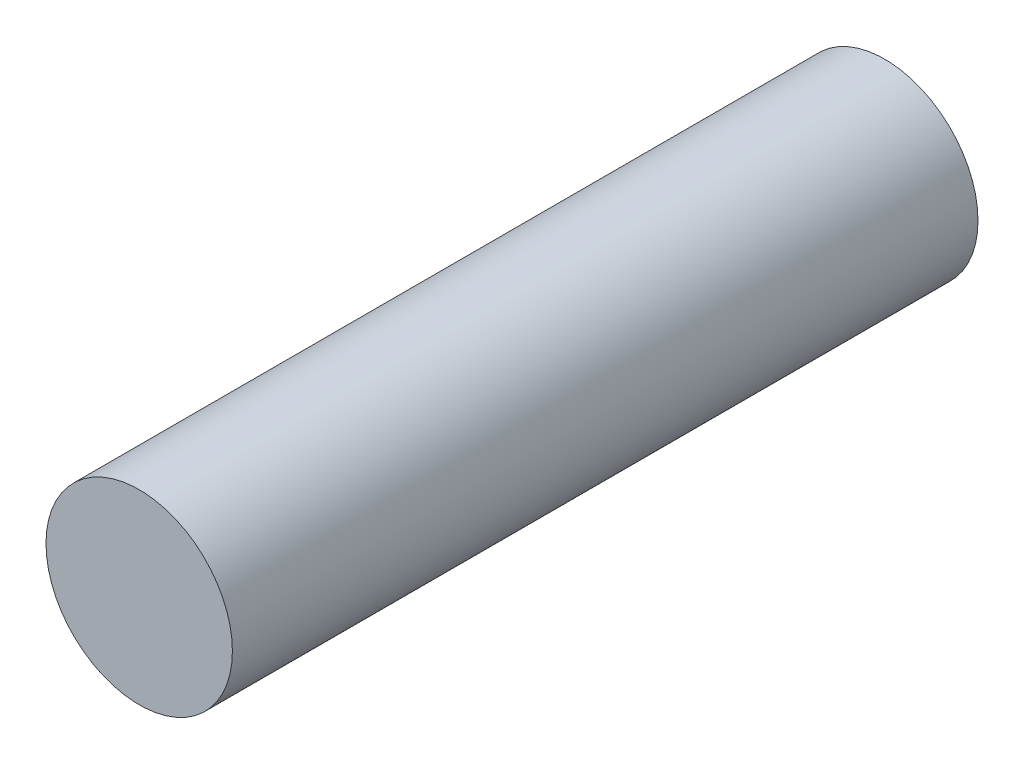
ISO-10303-21;
HEADER;
FILE_DESCRIPTION(('STEP AP214'),'2;1');
FILE_NAME('part.step','',(''),(''),'','','');
FILE_SCHEMA(('AUTOMOTIVE_DESIGN { 1 0 10303 214 1 1 1 1 }'));
ENDSEC;
DATA;
#1=APPLICATION_CONTEXT('core data for automotive mechanical design processes');
#2=APPLICATION_PROTOCOL_DEFINITION('international standard','automotive_design',2000,#1);
#3=PRODUCT_CONTEXT('',#1,'mechanical');
#4=PRODUCT('Part','Part','',(#3));
#5=PRODUCT_RELATED_PRODUCT_CATEGORY('part','',(#4));
#6=PRODUCT_DEFINITION_FORMATION('','',#4);
#7=PRODUCT_DEFINITION_CONTEXT('part definition',#1,'design');
#8=PRODUCT_DEFINITION('design','',#6,#7);
#9=PRODUCT_DEFINITION_SHAPE('','',#8);
#10=(LENGTH_UNIT() NAMED_UNIT(*) SI_UNIT(.MILLI.,.METRE.));
#11=(NAMED_UNIT(*) PLANE_ANGLE_UNIT() SI_UNIT($,.RADIAN.));
#12=(NAMED_UNIT(*) SI_UNIT($,.STERADIAN.) SOLID_ANGLE_UNIT());
#13=UNCERTAINTY_MEASURE_WITH_UNIT(LENGTH_MEASURE(1.E-05),#10,'distance_accuracy_value','');
#14=(GEOMETRIC_REPRESENTATION_CONTEXT(3) GLOBAL_UNCERTAINTY_ASSIGNED_CONTEXT((#13)) GLOBAL_UNIT_ASSIGNED_CONTEXT((#10,
#11,#12)) REPRESENTATION_CONTEXT('',''));
#15=CARTESIAN_POINT('',(0.,0.,0.));
#16=DIRECTION('',(0.,0.,1.));
#17=DIRECTION('',(1.,0.,0.));
#18=AXIS2_PLACEMENT_3D('',#15,#16,#17);
#19=CARTESIAN_POINT('',(0.,0.,4.));
#20=DIRECTION('',(0.,0.,-1.));
#21=DIRECTION('',(-1.,0.,0.));
#22=AXIS2_PLACEMENT_3D('',#19,#20,#21);
#23=CYLINDRICAL_SURFACE('',#22,0.5);
#24=CARTESIAN_POINT('',(0.,0.,4.));
#25=DIRECTION('',(0.,0.,1.));
#26=DIRECTION('',(1.,0.,0.));
#27=AXIS2_PLACEMENT_3D('',#24,#25,#26);
#28=CIRCLE('',#27,0.5);
#29=CARTESIAN_POINT('',(0.5,0.,4.));
#30=VERTEX_POINT('',#29);
#31=EDGE_CURVE('E10',#30,#30,#28,.T.);
#32=ORIENTED_EDGE('',*,*,#31,.F.);
#33=EDGE_LOOP('',(#32));
#34=FACE_BOUND('',#33,.T.);
#35=CARTESIAN_POINT('',(0.,0.,0.));
#36=DIRECTION('',(0.,0.,1.));
#37=DIRECTION('',(1.,0.,0.));
#38=AXIS2_PLACEMENT_3D('',#35,#36,#37);
#39=CIRCLE('',#38,0.5);
#40=CARTESIAN_POINT('',(0.5,0.,0.));
#41=VERTEX_POINT('',#40);
#42=EDGE_CURVE('E33',#41,#41,#39,.T.);
#43=ORIENTED_EDGE('',*,*,#42,.T.);
#44=EDGE_LOOP('',(#43));
#45=FACE_BOUND('',#44,.T.);
#46=ADVANCED_FACE('F30',(#34,#45),#23,.T.);
#47=CARTESIAN_POINT('',(0.,0.,4.));
#48=DIRECTION('',(0.,0.,1.));
#49=DIRECTION('',(1.,0.,0.));
#50=AXIS2_PLACEMENT_3D('',#47,#48,#49);
#51=PLANE('',#50);
#52=ORIENTED_EDGE('',*,*,#31,.T.);
#53=EDGE_LOOP('',(#52));
#54=FACE_BOUND('',#53,.T.);
#55=ADVANCED_FACE('F45',(#54),#51,.T.);
#56=CARTESIAN_POINT('',(0.,0.,0.));
#57=DIRECTION('',(0.,0.,1.));
#58=DIRECTION('',(1.,0.,0.));
#59=AXIS2_PLACEMENT_3D('',#56,#57,#58);
#60=PLANE('',#59);
#61=ORIENTED_EDGE('',*,*,#42,.F.);
#62=EDGE_LOOP('',(#61));
#63=FACE_BOUND('',#62,.T.);
#64=ADVANCED_FACE('F43',(#63),#60,.F.);
#65=CLOSED_SHELL('',(#46,#55,#64));
#66=MANIFOLD_SOLID_BREP('B2',#65);
#67=ADVANCED_BREP_SHAPE_REPRESENTATION('',(#18,#66),#14);
#68=SHAPE_DEFINITION_REPRESENTATION(#9,#67);
ENDSEC;
END-ISO-10303-21;
